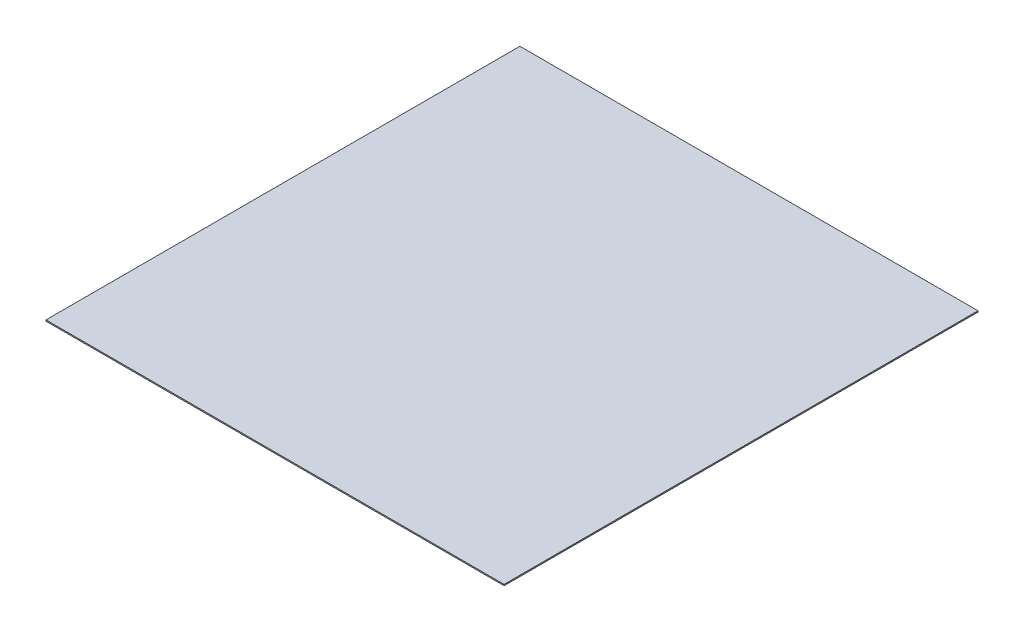
ISO-10303-21;
HEADER;
FILE_DESCRIPTION(('STEP AP214'),'2;1');
FILE_NAME('part.step','',(''),(''),'','','');
FILE_SCHEMA(('AUTOMOTIVE_DESIGN { 1 0 10303 214 1 1 1 1 }'));
ENDSEC;
DATA;
#1=APPLICATION_CONTEXT('core data for automotive mechanical design processes');
#2=APPLICATION_PROTOCOL_DEFINITION('international standard','automotive_design',2000,#1);
#3=PRODUCT_CONTEXT('',#1,'mechanical');
#4=PRODUCT('Part','Part','',(#3));
#5=PRODUCT_RELATED_PRODUCT_CATEGORY('part','',(#4));
#6=PRODUCT_DEFINITION_FORMATION('','',#4);
#7=PRODUCT_DEFINITION_CONTEXT('part definition',#1,'design');
#8=PRODUCT_DEFINITION('design','',#6,#7);
#9=PRODUCT_DEFINITION_SHAPE('','',#8);
#10=(LENGTH_UNIT() NAMED_UNIT(*) SI_UNIT(.MILLI.,.METRE.));
#11=(NAMED_UNIT(*) PLANE_ANGLE_UNIT() SI_UNIT($,.RADIAN.));
#12=(NAMED_UNIT(*) SI_UNIT($,.STERADIAN.) SOLID_ANGLE_UNIT());
#13=UNCERTAINTY_MEASURE_WITH_UNIT(LENGTH_MEASURE(1.E-05),#10,'distance_accuracy_value','');
#14=(GEOMETRIC_REPRESENTATION_CONTEXT(3) GLOBAL_UNCERTAINTY_ASSIGNED_CONTEXT((#13)) GLOBAL_UNIT_ASSIGNED_CONTEXT((#10,
#11,#12)) REPRESENTATION_CONTEXT('',''));
#15=CARTESIAN_POINT('',(0.,0.,0.));
#16=DIRECTION('',(0.,0.,1.));
#17=DIRECTION('',(1.,0.,0.));
#18=AXIS2_PLACEMENT_3D('',#15,#16,#17);
#19=CARTESIAN_POINT('',(-9.6048,0.05,-9.936));
#20=DIRECTION('',(1.,0.,0.));
#21=DIRECTION('',(0.,0.,-1.));
#22=AXIS2_PLACEMENT_3D('',#19,#20,#21);
#23=PLANE('',#22);
#24=DIRECTION('',(0.,0.,1.));
#25=VECTOR('',#24,1.);
#26=CARTESIAN_POINT('',(-9.6048,0.,-9.936));
#27=LINE('',#26,#25);
#28=CARTESIAN_POINT('',(-9.6048,0.,-9.936));
#29=VERTEX_POINT('',#28);
#30=CARTESIAN_POINT('',(-9.6048,0.,9.936));
#31=VERTEX_POINT('',#30);
#32=EDGE_CURVE('E95',#29,#31,#27,.T.);
#33=ORIENTED_EDGE('',*,*,#32,.T.);
#34=DIRECTION('',(0.,-1.,0.));
#35=VECTOR('',#34,1.);
#36=CARTESIAN_POINT('',(-9.6048,0.05,9.936));
#37=LINE('',#36,#35);
#38=CARTESIAN_POINT('',(-9.6048,0.05,9.936));
#39=VERTEX_POINT('',#38);
#40=EDGE_CURVE('E11',#39,#31,#37,.T.);
#41=ORIENTED_EDGE('',*,*,#40,.F.);
#42=DIRECTION('',(0.,0.,1.));
#43=VECTOR('',#42,1.);
#44=CARTESIAN_POINT('',(-9.6048,0.05,-9.936));
#45=LINE('',#44,#43);
#46=CARTESIAN_POINT('',(-9.6048,0.05,-9.936));
#47=VERTEX_POINT('',#46);
#48=EDGE_CURVE('E83',#47,#39,#45,.T.);
#49=ORIENTED_EDGE('',*,*,#48,.F.);
#50=DIRECTION('',(0.,-1.,0.));
#51=VECTOR('',#50,1.);
#52=CARTESIAN_POINT('',(-9.6048,0.05,-9.936));
#53=LINE('',#52,#51);
#54=EDGE_CURVE('E91',#47,#29,#53,.T.);
#55=ORIENTED_EDGE('',*,*,#54,.T.);
#56=EDGE_LOOP('',(#33,#41,#49,#55));
#57=FACE_BOUND('',#56,.T.);
#58=ADVANCED_FACE('F32',(#57),#23,.F.);
#59=CARTESIAN_POINT('',(-9.6048,0.05,9.936));
#60=DIRECTION('',(0.,0.,-1.));
#61=DIRECTION('',(-1.,0.,0.));
#62=AXIS2_PLACEMENT_3D('',#59,#60,#61);
#63=PLANE('',#62);
#64=DIRECTION('',(1.,0.,0.));
#65=VECTOR('',#64,1.);
#66=CARTESIAN_POINT('',(-9.6048,0.,9.936));
#67=LINE('',#66,#65);
#68=CARTESIAN_POINT('',(9.6048,0.,9.936));
#69=VERTEX_POINT('',#68);
#70=EDGE_CURVE('E87',#31,#69,#67,.T.);
#71=ORIENTED_EDGE('',*,*,#70,.T.);
#72=DIRECTION('',(0.,-1.,0.));
#73=VECTOR('',#72,1.);
#74=CARTESIAN_POINT('',(9.6048,0.05,9.936));
#75=LINE('',#74,#73);
#76=CARTESIAN_POINT('',(9.6048,0.05,9.936));
#77=VERTEX_POINT('',#76);
#78=EDGE_CURVE('E40',#77,#69,#75,.T.);
#79=ORIENTED_EDGE('',*,*,#78,.F.);
#80=DIRECTION('',(1.,0.,0.));
#81=VECTOR('',#80,1.);
#82=CARTESIAN_POINT('',(-9.6048,0.05,9.936));
#83=LINE('',#82,#81);
#84=EDGE_CURVE('E78',#39,#77,#83,.T.);
#85=ORIENTED_EDGE('',*,*,#84,.F.);
#86=ORIENTED_EDGE('',*,*,#40,.T.);
#87=EDGE_LOOP('',(#71,#79,#85,#86));
#88=FACE_BOUND('',#87,.T.);
#89=ADVANCED_FACE('F86',(#88),#63,.F.);
#90=CARTESIAN_POINT('',(9.6048,0.05,-9.936));
#91=DIRECTION('',(-1.,0.,0.));
#92=DIRECTION('',(0.,0.,1.));
#93=AXIS2_PLACEMENT_3D('',#90,#91,#92);
#94=PLANE('',#93);
#95=DIRECTION('',(0.,0.,-1.));
#96=VECTOR('',#95,1.);
#97=CARTESIAN_POINT('',(9.6048,0.,-9.936));
#98=LINE('',#97,#96);
#99=CARTESIAN_POINT('',(9.6048,0.,-9.936));
#100=VERTEX_POINT('',#99);
#101=EDGE_CURVE('E65',#69,#100,#98,.T.);
#102=ORIENTED_EDGE('',*,*,#101,.T.);
#103=DIRECTION('',(0.,-1.,0.));
#104=VECTOR('',#103,1.);
#105=CARTESIAN_POINT('',(9.6048,0.05,-9.936));
#106=LINE('',#105,#104);
#107=CARTESIAN_POINT('',(9.6048,0.05,-9.936));
#108=VERTEX_POINT('',#107);
#109=EDGE_CURVE('E88',#108,#100,#106,.T.);
#110=ORIENTED_EDGE('',*,*,#109,.F.);
#111=DIRECTION('',(0.,0.,-1.));
#112=VECTOR('',#111,1.);
#113=CARTESIAN_POINT('',(9.6048,0.05,-9.936));
#114=LINE('',#113,#112);
#115=EDGE_CURVE('E81',#77,#108,#114,.T.);
#116=ORIENTED_EDGE('',*,*,#115,.F.);
#117=ORIENTED_EDGE('',*,*,#78,.T.);
#118=EDGE_LOOP('',(#102,#110,#116,#117));
#119=FACE_BOUND('',#118,.T.);
#120=ADVANCED_FACE('F89',(#119),#94,.F.);
#121=CARTESIAN_POINT('',(-9.6048,0.05,-9.936));
#122=DIRECTION('',(0.,0.,1.));
#123=DIRECTION('',(1.,0.,0.));
#124=AXIS2_PLACEMENT_3D('',#121,#122,#123);
#125=PLANE('',#124);
#126=DIRECTION('',(-1.,0.,0.));
#127=VECTOR('',#126,1.);
#128=CARTESIAN_POINT('',(-9.6048,0.,-9.936));
#129=LINE('',#128,#127);
#130=EDGE_CURVE('E71',#100,#29,#129,.T.);
#131=ORIENTED_EDGE('',*,*,#130,.T.);
#132=ORIENTED_EDGE('',*,*,#54,.F.);
#133=DIRECTION('',(-1.,0.,0.));
#134=VECTOR('',#133,1.);
#135=CARTESIAN_POINT('',(-9.6048,0.05,-9.936));
#136=LINE('',#135,#134);
#137=EDGE_CURVE('E48',#108,#47,#136,.T.);
#138=ORIENTED_EDGE('',*,*,#137,.F.);
#139=ORIENTED_EDGE('',*,*,#109,.T.);
#140=EDGE_LOOP('',(#131,#132,#138,#139));
#141=FACE_BOUND('',#140,.T.);
#142=ADVANCED_FACE('F102',(#141),#125,.F.);
#143=CARTESIAN_POINT('',(-9.6048,0.05,9.936));
#144=DIRECTION('',(0.,1.,0.));
#145=DIRECTION('',(0.,0.,1.));
#146=AXIS2_PLACEMENT_3D('',#143,#144,#145);
#147=PLANE('',#146);
#148=ORIENTED_EDGE('',*,*,#48,.T.);
#149=ORIENTED_EDGE('',*,*,#84,.T.);
#150=ORIENTED_EDGE('',*,*,#115,.T.);
#151=ORIENTED_EDGE('',*,*,#137,.T.);
#152=EDGE_LOOP('',(#148,#149,#150,#151));
#153=FACE_BOUND('',#152,.T.);
#154=ADVANCED_FACE('F79',(#153),#147,.T.);
#155=CARTESIAN_POINT('',(-9.6048,0.,9.936));
#156=DIRECTION('',(0.,1.,0.));
#157=DIRECTION('',(0.,0.,1.));
#158=AXIS2_PLACEMENT_3D('',#155,#156,#157);
#159=PLANE('',#158);
#160=ORIENTED_EDGE('',*,*,#32,.F.);
#161=ORIENTED_EDGE('',*,*,#130,.F.);
#162=ORIENTED_EDGE('',*,*,#101,.F.);
#163=ORIENTED_EDGE('',*,*,#70,.F.);
#164=EDGE_LOOP('',(#160,#161,#162,#163));
#165=FACE_BOUND('',#164,.T.);
#166=ADVANCED_FACE('F105',(#165),#159,.F.);
#167=CLOSED_SHELL('',(#58,#89,#120,#142,#154,#166));
#168=MANIFOLD_SOLID_BREP('B2',#167);
#169=ADVANCED_BREP_SHAPE_REPRESENTATION('',(#18,#168),#14);
#170=SHAPE_DEFINITION_REPRESENTATION(#9,#169);
ENDSEC;
END-ISO-10303-21;
